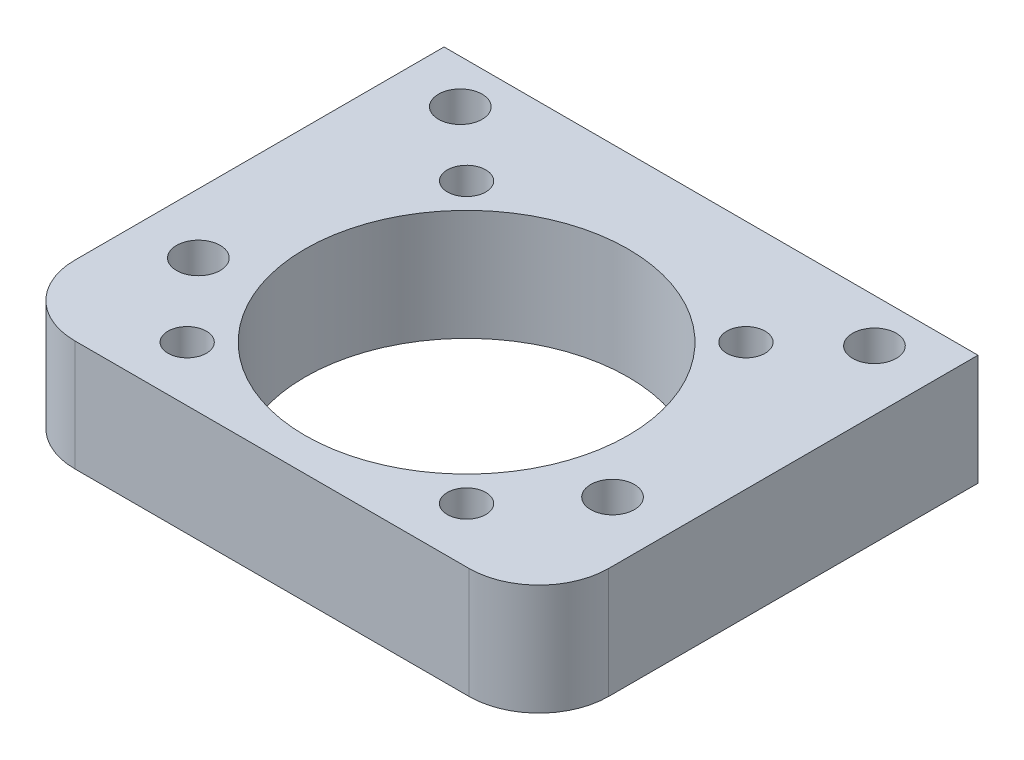
ISO-10303-21;
HEADER;
FILE_DESCRIPTION(('STEP AP214'),'2;1');
FILE_NAME('part.step','',(''),(''),'','','');
FILE_SCHEMA(('AUTOMOTIVE_DESIGN { 1 0 10303 214 1 1 1 1 }'));
ENDSEC;
DATA;
#1=APPLICATION_CONTEXT('core data for automotive mechanical design processes');
#2=APPLICATION_PROTOCOL_DEFINITION('international standard','automotive_design',2000,#1);
#3=PRODUCT_CONTEXT('',#1,'mechanical');
#4=PRODUCT('Part','Part','',(#3));
#5=PRODUCT_RELATED_PRODUCT_CATEGORY('part','',(#4));
#6=PRODUCT_DEFINITION_FORMATION('','',#4);
#7=PRODUCT_DEFINITION_CONTEXT('part definition',#1,'design');
#8=PRODUCT_DEFINITION('design','',#6,#7);
#9=PRODUCT_DEFINITION_SHAPE('','',#8);
#10=(LENGTH_UNIT() NAMED_UNIT(*) SI_UNIT(.MILLI.,.METRE.));
#11=(NAMED_UNIT(*) PLANE_ANGLE_UNIT() SI_UNIT($,.RADIAN.));
#12=(NAMED_UNIT(*) SI_UNIT($,.STERADIAN.) SOLID_ANGLE_UNIT());
#13=UNCERTAINTY_MEASURE_WITH_UNIT(LENGTH_MEASURE(1.E-05),#10,'distance_accuracy_value','');
#14=(GEOMETRIC_REPRESENTATION_CONTEXT(3) GLOBAL_UNCERTAINTY_ASSIGNED_CONTEXT((#13)) GLOBAL_UNIT_ASSIGNED_CONTEXT((#10,
#11,#12)) REPRESENTATION_CONTEXT('',''));
#15=CARTESIAN_POINT('',(0.,0.,0.));
#16=DIRECTION('',(0.,0.,1.));
#17=DIRECTION('',(1.,0.,0.));
#18=AXIS2_PLACEMENT_3D('',#15,#16,#17);
#19=CARTESIAN_POINT('',(11.2889800951195,0.,7.15000000000087));
#20=DIRECTION('',(0.,1.,0.));
#21=DIRECTION('',(0.,0.,1.));
#22=AXIS2_PLACEMENT_3D('',#19,#20,#21);
#23=CYLINDRICAL_SURFACE('',#22,4.00000000000011);
#24=CARTESIAN_POINT('',(11.2889800951195,6.34999999999999,7.15000000000087));
#25=DIRECTION('',(0.,1.,0.));
#26=DIRECTION('',(0.,0.,1.));
#27=AXIS2_PLACEMENT_3D('',#24,#25,#26);
#28=CIRCLE('',#27,4.00000000000011);
#29=CARTESIAN_POINT('',(11.2889800951195,6.34999999999999,11.150000000001));
#30=VERTEX_POINT('',#29);
#31=CARTESIAN_POINT('',(15.2889800951196,6.34999999999999,7.15000000000087));
#32=VERTEX_POINT('',#31);
#33=EDGE_CURVE('E122',#30,#32,#28,.T.);
#34=ORIENTED_EDGE('',*,*,#33,.F.);
#35=DIRECTION('',(0.,1.,0.));
#36=VECTOR('',#35,1.);
#37=CARTESIAN_POINT('',(11.2889800951195,0.,11.150000000001));
#38=LINE('',#37,#36);
#39=CARTESIAN_POINT('',(11.2889800951195,0.,11.150000000001));
#40=VERTEX_POINT('',#39);
#41=EDGE_CURVE('E11',#40,#30,#38,.T.);
#42=ORIENTED_EDGE('',*,*,#41,.F.);
#43=CARTESIAN_POINT('',(11.2889800951195,0.,7.15000000000087));
#44=DIRECTION('',(0.,1.,0.));
#45=DIRECTION('',(0.,0.,1.));
#46=AXIS2_PLACEMENT_3D('',#43,#44,#45);
#47=CIRCLE('',#46,4.00000000000011);
#48=CARTESIAN_POINT('',(15.2889800951196,0.,7.15000000000087));
#49=VERTEX_POINT('',#48);
#50=EDGE_CURVE('E137',#40,#49,#47,.T.);
#51=ORIENTED_EDGE('',*,*,#50,.T.);
#52=DIRECTION('',(0.,1.,0.));
#53=VECTOR('',#52,1.);
#54=CARTESIAN_POINT('',(15.2889800951196,0.,7.15000000000087));
#55=LINE('',#54,#53);
#56=EDGE_CURVE('E40',#49,#32,#55,.T.);
#57=ORIENTED_EDGE('',*,*,#56,.T.);
#58=EDGE_LOOP('',(#34,#42,#51,#57));
#59=FACE_BOUND('',#58,.T.);
#60=ADVANCED_FACE('F37',(#59),#23,.T.);
#61=CARTESIAN_POINT('',(-11.2890199048789,0.,11.150000000001));
#62=DIRECTION('',(0.,0.,1.));
#63=DIRECTION('',(1.,0.,0.));
#64=AXIS2_PLACEMENT_3D('',#61,#62,#63);
#65=PLANE('',#64);
#66=DIRECTION('',(1.,0.,0.));
#67=VECTOR('',#66,1.);
#68=CARTESIAN_POINT('',(-11.2890199048789,6.34999999999999,11.150000000001));
#69=LINE('',#68,#67);
#70=CARTESIAN_POINT('',(-11.2890199048789,6.34999999999999,11.150000000001));
#71=VERTEX_POINT('',#70);
#72=EDGE_CURVE('E135',#71,#30,#69,.T.);
#73=ORIENTED_EDGE('',*,*,#72,.F.);
#74=DIRECTION('',(0.,1.,0.));
#75=VECTOR('',#74,1.);
#76=CARTESIAN_POINT('',(-11.2890199048789,0.,11.150000000001));
#77=LINE('',#76,#75);
#78=CARTESIAN_POINT('',(-11.2890199048789,0.,11.150000000001));
#79=VERTEX_POINT('',#78);
#80=EDGE_CURVE('E46',#79,#71,#77,.T.);
#81=ORIENTED_EDGE('',*,*,#80,.F.);
#82=DIRECTION('',(1.,0.,0.));
#83=VECTOR('',#82,1.);
#84=CARTESIAN_POINT('',(-11.2890199048789,0.,11.150000000001));
#85=LINE('',#84,#83);
#86=EDGE_CURVE('E112',#79,#40,#85,.T.);
#87=ORIENTED_EDGE('',*,*,#86,.T.);
#88=ORIENTED_EDGE('',*,*,#41,.T.);
#89=EDGE_LOOP('',(#73,#81,#87,#88));
#90=FACE_BOUND('',#89,.T.);
#91=ADVANCED_FACE('F145',(#90),#65,.T.);
#92=CARTESIAN_POINT('',(-11.2890199048789,0.,7.14999999999758));
#93=DIRECTION('',(0.,1.,0.));
#94=DIRECTION('',(0.,0.,1.));
#95=AXIS2_PLACEMENT_3D('',#92,#93,#94);
#96=CYLINDRICAL_SURFACE('',#95,4.00000000000341);
#97=CARTESIAN_POINT('',(-11.2890199048789,6.34999999999999,7.14999999999758));
#98=DIRECTION('',(0.,1.,0.));
#99=DIRECTION('',(0.,0.,1.));
#100=AXIS2_PLACEMENT_3D('',#97,#98,#99);
#101=CIRCLE('',#100,4.00000000000341);
#102=CARTESIAN_POINT('',(-15.2890199048824,6.34999999999999,7.14999999999758));
#103=VERTEX_POINT('',#102);
#104=EDGE_CURVE('E99',#103,#71,#101,.T.);
#105=ORIENTED_EDGE('',*,*,#104,.F.);
#106=DIRECTION('',(0.,1.,0.));
#107=VECTOR('',#106,1.);
#108=CARTESIAN_POINT('',(-15.2890199048824,0.,7.14999999999758));
#109=LINE('',#108,#107);
#110=CARTESIAN_POINT('',(-15.2890199048824,0.,7.14999999999758));
#111=VERTEX_POINT('',#110);
#112=EDGE_CURVE('E94',#111,#103,#109,.T.);
#113=ORIENTED_EDGE('',*,*,#112,.F.);
#114=CARTESIAN_POINT('',(-11.2890199048789,0.,7.14999999999758));
#115=DIRECTION('',(0.,1.,0.));
#116=DIRECTION('',(0.,0.,1.));
#117=AXIS2_PLACEMENT_3D('',#114,#115,#116);
#118=CIRCLE('',#117,4.00000000000341);
#119=EDGE_CURVE('E97',#111,#79,#118,.T.);
#120=ORIENTED_EDGE('',*,*,#119,.T.);
#121=ORIENTED_EDGE('',*,*,#80,.T.);
#122=EDGE_LOOP('',(#105,#113,#120,#121));
#123=FACE_BOUND('',#122,.T.);
#124=ADVANCED_FACE('F96',(#123),#96,.T.);
#125=CARTESIAN_POINT('',(-15.2890199048824,0.,-14.0000000000007));
#126=DIRECTION('',(-1.,0.,0.));
#127=DIRECTION('',(0.,0.,1.));
#128=AXIS2_PLACEMENT_3D('',#125,#126,#127);
#129=PLANE('',#128);
#130=DIRECTION('',(0.,0.,1.));
#131=VECTOR('',#130,1.);
#132=CARTESIAN_POINT('',(-15.2890199048824,6.34999999999999,-14.0000000000007));
#133=LINE('',#132,#131);
#134=CARTESIAN_POINT('',(-15.2890199048824,6.34999999999999,-14.0000000000007));
#135=VERTEX_POINT('',#134);
#136=EDGE_CURVE('E132',#135,#103,#133,.T.);
#137=ORIENTED_EDGE('',*,*,#136,.F.);
#138=DIRECTION('',(0.,1.,0.));
#139=VECTOR('',#138,1.);
#140=CARTESIAN_POINT('',(-15.2890199048824,0.,-14.0000000000007));
#141=LINE('',#140,#139);
#142=CARTESIAN_POINT('',(-15.2890199048824,0.,-14.0000000000007));
#143=VERTEX_POINT('',#142);
#144=EDGE_CURVE('E104',#143,#135,#141,.T.);
#145=ORIENTED_EDGE('',*,*,#144,.F.);
#146=DIRECTION('',(0.,0.,1.));
#147=VECTOR('',#146,1.);
#148=CARTESIAN_POINT('',(-15.2890199048824,0.,-14.0000000000007));
#149=LINE('',#148,#147);
#150=EDGE_CURVE('E110',#143,#111,#149,.T.);
#151=ORIENTED_EDGE('',*,*,#150,.T.);
#152=ORIENTED_EDGE('',*,*,#112,.T.);
#153=EDGE_LOOP('',(#137,#145,#151,#152));
#154=FACE_BOUND('',#153,.T.);
#155=ADVANCED_FACE('F114',(#154),#129,.T.);
#156=CARTESIAN_POINT('',(15.2889800951196,0.,-14.0000000000007));
#157=DIRECTION('',(0.,0.,-1.));
#158=DIRECTION('',(-1.,0.,0.));
#159=AXIS2_PLACEMENT_3D('',#156,#157,#158);
#160=PLANE('',#159);
#161=DIRECTION('',(-1.,0.,0.));
#162=VECTOR('',#161,1.);
#163=CARTESIAN_POINT('',(15.2889800951196,6.34999999999999,-14.0000000000007));
#164=LINE('',#163,#162);
#165=CARTESIAN_POINT('',(15.2889800951196,6.34999999999999,-14.0000000000007));
#166=VERTEX_POINT('',#165);
#167=EDGE_CURVE('E129',#166,#135,#164,.T.);
#168=ORIENTED_EDGE('',*,*,#167,.F.);
#169=DIRECTION('',(0.,1.,0.));
#170=VECTOR('',#169,1.);
#171=CARTESIAN_POINT('',(15.2889800951196,0.,-14.0000000000007));
#172=LINE('',#171,#170);
#173=CARTESIAN_POINT('',(15.2889800951196,0.,-14.0000000000007));
#174=VERTEX_POINT('',#173);
#175=EDGE_CURVE('E140',#174,#166,#172,.T.);
#176=ORIENTED_EDGE('',*,*,#175,.F.);
#177=DIRECTION('',(-1.,0.,0.));
#178=VECTOR('',#177,1.);
#179=CARTESIAN_POINT('',(15.2889800951196,0.,-14.0000000000007));
#180=LINE('',#179,#178);
#181=EDGE_CURVE('E115',#174,#143,#180,.T.);
#182=ORIENTED_EDGE('',*,*,#181,.T.);
#183=ORIENTED_EDGE('',*,*,#144,.T.);
#184=EDGE_LOOP('',(#168,#176,#182,#183));
#185=FACE_BOUND('',#184,.T.);
#186=ADVANCED_FACE('F158',(#185),#160,.T.);
#187=CARTESIAN_POINT('',(15.2889800951196,0.,7.15000000000087));
#188=DIRECTION('',(1.,0.,0.));
#189=DIRECTION('',(0.,0.,-1.));
#190=AXIS2_PLACEMENT_3D('',#187,#188,#189);
#191=PLANE('',#190);
#192=DIRECTION('',(0.,0.,-1.));
#193=VECTOR('',#192,1.);
#194=CARTESIAN_POINT('',(15.2889800951196,6.34999999999999,7.15000000000087));
#195=LINE('',#194,#193);
#196=EDGE_CURVE('E125',#32,#166,#195,.T.);
#197=ORIENTED_EDGE('',*,*,#196,.F.);
#198=ORIENTED_EDGE('',*,*,#56,.F.);
#199=DIRECTION('',(0.,0.,-1.));
#200=VECTOR('',#199,1.);
#201=CARTESIAN_POINT('',(15.2889800951196,0.,7.15000000000087));
#202=LINE('',#201,#200);
#203=EDGE_CURVE('E117',#49,#174,#202,.T.);
#204=ORIENTED_EDGE('',*,*,#203,.T.);
#205=ORIENTED_EDGE('',*,*,#175,.T.);
#206=EDGE_LOOP('',(#197,#198,#204,#205));
#207=FACE_BOUND('',#206,.T.);
#208=ADVANCED_FACE('F142',(#207),#191,.T.);
#209=CARTESIAN_POINT('',(11.2889800951195,0.,7.15000000000087));
#210=DIRECTION('',(0.,1.,0.));
#211=DIRECTION('',(0.,0.,1.));
#212=AXIS2_PLACEMENT_3D('',#209,#210,#211);
#213=PLANE('',#212);
#214=CARTESIAN_POINT('',(11.859575542256,0.,3.50000000000059));
#215=DIRECTION('',(0.,-1.,0.));
#216=DIRECTION('',(0.,0.,-1.));
#217=AXIS2_PLACEMENT_3D('',#214,#215,#216);
#218=CIRCLE('',#217,1.24999999999999);
#219=CARTESIAN_POINT('',(11.859575542256,0.,2.2500000000006));
#220=VERTEX_POINT('',#219);
#221=EDGE_CURVE('E215',#220,#220,#218,.T.);
#222=ORIENTED_EDGE('',*,*,#221,.F.);
#223=EDGE_LOOP('',(#222));
#224=FACE_BOUND('',#223,.T.);
#225=CARTESIAN_POINT('',(11.8586470054873,0.,-11.4999999999994));
#226=DIRECTION('',(0.,-1.,0.));
#227=DIRECTION('',(0.,0.,-1.));
#228=AXIS2_PLACEMENT_3D('',#225,#226,#227);
#229=CIRCLE('',#228,1.24999999999999);
#230=CARTESIAN_POINT('',(11.8586470054873,0.,-12.7499999999994));
#231=VERTEX_POINT('',#230);
#232=EDGE_CURVE('E217',#231,#231,#229,.T.);
#233=ORIENTED_EDGE('',*,*,#232,.F.);
#234=EDGE_LOOP('',(#233));
#235=FACE_BOUND('',#234,.T.);
#236=CARTESIAN_POINT('',(-11.8595655897677,0.,3.50003372333488));
#237=DIRECTION('',(0.,-1.,0.));
#238=DIRECTION('',(0.,0.,-1.));
#239=AXIS2_PLACEMENT_3D('',#236,#237,#238);
#240=CIRCLE('',#239,1.24999999999999);
#241=CARTESIAN_POINT('',(-11.8595655897677,0.,2.25003372333489));
#242=VERTEX_POINT('',#241);
#243=EDGE_CURVE('E225',#242,#242,#240,.T.);
#244=ORIENTED_EDGE('',*,*,#243,.F.);
#245=EDGE_LOOP('',(#244));
#246=FACE_BOUND('',#245,.T.);
#247=CARTESIAN_POINT('',(-11.8586370762849,0.,-11.4999999999994));
#248=DIRECTION('',(0.,-1.,0.));
#249=DIRECTION('',(0.,0.,-1.));
#250=AXIS2_PLACEMENT_3D('',#247,#248,#249);
#251=CIRCLE('',#250,1.24999999999999);
#252=CARTESIAN_POINT('',(-11.8586370762849,0.,-12.7499999999994));
#253=VERTEX_POINT('',#252);
#254=EDGE_CURVE('E231',#253,#253,#251,.T.);
#255=ORIENTED_EDGE('',*,*,#254,.F.);
#256=EDGE_LOOP('',(#255));
#257=FACE_BOUND('',#256,.T.);
#258=CARTESIAN_POINT('',(0.,0.,0.));
#259=DIRECTION('',(0.,-1.,0.));
#260=DIRECTION('',(0.,0.,-1.));
#261=AXIS2_PLACEMENT_3D('',#258,#259,#260);
#262=CIRCLE('',#261,9.25);
#263=CARTESIAN_POINT('',(0.,0.,-9.25));
#264=VERTEX_POINT('',#263);
#265=EDGE_CURVE('E237',#264,#264,#262,.T.);
#266=ORIENTED_EDGE('',*,*,#265,.F.);
#267=EDGE_LOOP('',(#266));
#268=FACE_BOUND('',#267,.T.);
#269=CARTESIAN_POINT('',(-8.00001990488033,0.,8.00000000000009));
#270=DIRECTION('',(0.,1.,0.));
#271=DIRECTION('',(0.,0.,1.));
#272=AXIS2_PLACEMENT_3D('',#269,#270,#271);
#273=CIRCLE('',#272,1.10000000000004);
#274=CARTESIAN_POINT('',(-8.00001990488033,0.,9.10000000000013));
#275=VERTEX_POINT('',#274);
#276=EDGE_CURVE('E246',#275,#275,#273,.T.);
#277=ORIENTED_EDGE('',*,*,#276,.T.);
#278=EDGE_LOOP('',(#277));
#279=FACE_BOUND('',#278,.T.);
#280=CARTESIAN_POINT('',(7.99998009511978,0.,-7.99999999999978));
#281=DIRECTION('',(0.,-1.,0.));
#282=DIRECTION('',(0.,0.,-1.));
#283=AXIS2_PLACEMENT_3D('',#280,#281,#282);
#284=CIRCLE('',#283,1.09999999999999);
#285=CARTESIAN_POINT('',(7.99998009511978,0.,-9.09999999999977));
#286=VERTEX_POINT('',#285);
#287=EDGE_CURVE('E249',#286,#286,#284,.T.);
#288=ORIENTED_EDGE('',*,*,#287,.F.);
#289=EDGE_LOOP('',(#288));
#290=FACE_BOUND('',#289,.T.);
#291=CARTESIAN_POINT('',(-8.00001990488031,0.,-7.9999999999998));
#292=DIRECTION('',(0.,-1.,0.));
#293=DIRECTION('',(0.,0.,-1.));
#294=AXIS2_PLACEMENT_3D('',#291,#292,#293);
#295=CIRCLE('',#294,1.10000000000004);
#296=CARTESIAN_POINT('',(-8.00001990488031,0.,-9.09999999999984));
#297=VERTEX_POINT('',#296);
#298=EDGE_CURVE('E255',#297,#297,#295,.T.);
#299=ORIENTED_EDGE('',*,*,#298,.F.);
#300=EDGE_LOOP('',(#299));
#301=FACE_BOUND('',#300,.T.);
#302=CARTESIAN_POINT('',(7.99998009511976,0.,8.00000000000012));
#303=DIRECTION('',(0.,-1.,0.));
#304=DIRECTION('',(0.,0.,-1.));
#305=AXIS2_PLACEMENT_3D('',#302,#303,#304);
#306=CIRCLE('',#305,1.10000000000004);
#307=CARTESIAN_POINT('',(7.99998009511976,0.,6.90000000000007));
#308=VERTEX_POINT('',#307);
#309=EDGE_CURVE('E261',#308,#308,#306,.T.);
#310=ORIENTED_EDGE('',*,*,#309,.F.);
#311=EDGE_LOOP('',(#310));
#312=FACE_BOUND('',#311,.T.);
#313=ORIENTED_EDGE('',*,*,#50,.F.);
#314=ORIENTED_EDGE('',*,*,#86,.F.);
#315=ORIENTED_EDGE('',*,*,#119,.F.);
#316=ORIENTED_EDGE('',*,*,#150,.F.);
#317=ORIENTED_EDGE('',*,*,#181,.F.);
#318=ORIENTED_EDGE('',*,*,#203,.F.);
#319=EDGE_LOOP('',(#313,#314,#315,#316,#317,#318));
#320=FACE_BOUND('',#319,.T.);
#321=ADVANCED_FACE('F108',(#224,#235,#246,#257,#268,#279,#290,#301,#312,#320),#213,.F.);
#322=CARTESIAN_POINT('',(11.2889800951195,6.34999999999999,7.15000000000087));
#323=DIRECTION('',(0.,1.,0.));
#324=DIRECTION('',(0.,0.,1.));
#325=AXIS2_PLACEMENT_3D('',#322,#323,#324);
#326=PLANE('',#325);
#327=CARTESIAN_POINT('',(11.859575542256,6.34999999999999,3.50000000000059));
#328=DIRECTION('',(0.,-1.,0.));
#329=DIRECTION('',(0.,0.,-1.));
#330=AXIS2_PLACEMENT_3D('',#327,#328,#329);
#331=CIRCLE('',#330,1.24999999999999);
#332=CARTESIAN_POINT('',(11.859575542256,6.34999999999999,2.2500000000006));
#333=VERTEX_POINT('',#332);
#334=EDGE_CURVE('E213',#333,#333,#331,.T.);
#335=ORIENTED_EDGE('',*,*,#334,.T.);
#336=EDGE_LOOP('',(#335));
#337=FACE_BOUND('',#336,.T.);
#338=CARTESIAN_POINT('',(11.8586470054873,6.34999999999999,-11.4999999999994));
#339=DIRECTION('',(0.,-1.,0.));
#340=DIRECTION('',(0.,0.,-1.));
#341=AXIS2_PLACEMENT_3D('',#338,#339,#340);
#342=CIRCLE('',#341,1.24999999999999);
#343=CARTESIAN_POINT('',(11.8586470054873,6.34999999999999,-12.7499999999994));
#344=VERTEX_POINT('',#343);
#345=EDGE_CURVE('E222',#344,#344,#342,.T.);
#346=ORIENTED_EDGE('',*,*,#345,.T.);
#347=EDGE_LOOP('',(#346));
#348=FACE_BOUND('',#347,.T.);
#349=CARTESIAN_POINT('',(-11.8595655897677,6.34999999999999,3.50003372333488));
#350=DIRECTION('',(0.,-1.,0.));
#351=DIRECTION('',(0.,0.,-1.));
#352=AXIS2_PLACEMENT_3D('',#349,#350,#351);
#353=CIRCLE('',#352,1.24999999999999);
#354=CARTESIAN_POINT('',(-11.8595655897677,6.34999999999999,2.25003372333489));
#355=VERTEX_POINT('',#354);
#356=EDGE_CURVE('E228',#355,#355,#353,.T.);
#357=ORIENTED_EDGE('',*,*,#356,.T.);
#358=EDGE_LOOP('',(#357));
#359=FACE_BOUND('',#358,.T.);
#360=CARTESIAN_POINT('',(-11.8586370762849,6.34999999999999,-11.4999999999994));
#361=DIRECTION('',(0.,-1.,0.));
#362=DIRECTION('',(0.,0.,-1.));
#363=AXIS2_PLACEMENT_3D('',#360,#361,#362);
#364=CIRCLE('',#363,1.24999999999999);
#365=CARTESIAN_POINT('',(-11.8586370762849,6.34999999999999,-12.7499999999994));
#366=VERTEX_POINT('',#365);
#367=EDGE_CURVE('E234',#366,#366,#364,.T.);
#368=ORIENTED_EDGE('',*,*,#367,.T.);
#369=EDGE_LOOP('',(#368));
#370=FACE_BOUND('',#369,.T.);
#371=CARTESIAN_POINT('',(0.,6.34999999999999,0.));
#372=DIRECTION('',(0.,-1.,0.));
#373=DIRECTION('',(0.,0.,-1.));
#374=AXIS2_PLACEMENT_3D('',#371,#372,#373);
#375=CIRCLE('',#374,9.25);
#376=CARTESIAN_POINT('',(0.,6.34999999999999,-9.25));
#377=VERTEX_POINT('',#376);
#378=EDGE_CURVE('E240',#377,#377,#375,.T.);
#379=ORIENTED_EDGE('',*,*,#378,.T.);
#380=EDGE_LOOP('',(#379));
#381=FACE_BOUND('',#380,.T.);
#382=CARTESIAN_POINT('',(-8.00001990488033,6.34999999999999,8.00000000000009));
#383=DIRECTION('',(0.,1.,0.));
#384=DIRECTION('',(0.,0.,1.));
#385=AXIS2_PLACEMENT_3D('',#382,#383,#384);
#386=CIRCLE('',#385,1.10000000000004);
#387=CARTESIAN_POINT('',(-8.00001990488033,6.34999999999999,9.10000000000013));
#388=VERTEX_POINT('',#387);
#389=EDGE_CURVE('E243',#388,#388,#386,.T.);
#390=ORIENTED_EDGE('',*,*,#389,.F.);
#391=EDGE_LOOP('',(#390));
#392=FACE_BOUND('',#391,.T.);
#393=CARTESIAN_POINT('',(7.99998009511978,6.34999999999999,-7.99999999999978));
#394=DIRECTION('',(0.,-1.,0.));
#395=DIRECTION('',(0.,0.,-1.));
#396=AXIS2_PLACEMENT_3D('',#393,#394,#395);
#397=CIRCLE('',#396,1.09999999999999);
#398=CARTESIAN_POINT('',(7.99998009511978,6.34999999999999,-9.09999999999977));
#399=VERTEX_POINT('',#398);
#400=EDGE_CURVE('E252',#399,#399,#397,.T.);
#401=ORIENTED_EDGE('',*,*,#400,.T.);
#402=EDGE_LOOP('',(#401));
#403=FACE_BOUND('',#402,.T.);
#404=CARTESIAN_POINT('',(-8.00001990488031,6.34999999999999,-7.9999999999998));
#405=DIRECTION('',(0.,-1.,0.));
#406=DIRECTION('',(0.,0.,-1.));
#407=AXIS2_PLACEMENT_3D('',#404,#405,#406);
#408=CIRCLE('',#407,1.10000000000004);
#409=CARTESIAN_POINT('',(-8.00001990488031,6.34999999999999,-9.09999999999984));
#410=VERTEX_POINT('',#409);
#411=EDGE_CURVE('E258',#410,#410,#408,.T.);
#412=ORIENTED_EDGE('',*,*,#411,.T.);
#413=EDGE_LOOP('',(#412));
#414=FACE_BOUND('',#413,.T.);
#415=CARTESIAN_POINT('',(7.99998009511976,6.34999999999999,8.00000000000012));
#416=DIRECTION('',(0.,-1.,0.));
#417=DIRECTION('',(0.,0.,-1.));
#418=AXIS2_PLACEMENT_3D('',#415,#416,#417);
#419=CIRCLE('',#418,1.10000000000004);
#420=CARTESIAN_POINT('',(7.99998009511976,6.34999999999999,6.90000000000007));
#421=VERTEX_POINT('',#420);
#422=EDGE_CURVE('E126',#421,#421,#419,.T.);
#423=ORIENTED_EDGE('',*,*,#422,.T.);
#424=EDGE_LOOP('',(#423));
#425=FACE_BOUND('',#424,.T.);
#426=ORIENTED_EDGE('',*,*,#33,.T.);
#427=ORIENTED_EDGE('',*,*,#196,.T.);
#428=ORIENTED_EDGE('',*,*,#167,.T.);
#429=ORIENTED_EDGE('',*,*,#136,.T.);
#430=ORIENTED_EDGE('',*,*,#104,.T.);
#431=ORIENTED_EDGE('',*,*,#72,.T.);
#432=EDGE_LOOP('',(#426,#427,#428,#429,#430,#431));
#433=FACE_BOUND('',#432,.T.);
#434=ADVANCED_FACE('F144',(#337,#348,#359,#370,#381,#392,#403,#414,#425,#433),#326,.T.);
#435=CARTESIAN_POINT('',(7.99998009511976,0.,8.00000000000012));
#436=DIRECTION('',(0.,-1.,0.));
#437=DIRECTION('',(0.,0.,-1.));
#438=AXIS2_PLACEMENT_3D('',#435,#436,#437);
#439=CYLINDRICAL_SURFACE('',#438,1.10000000000004);
#440=ORIENTED_EDGE('',*,*,#422,.F.);
#441=EDGE_LOOP('',(#440));
#442=FACE_BOUND('',#441,.T.);
#443=ORIENTED_EDGE('',*,*,#309,.T.);
#444=EDGE_LOOP('',(#443));
#445=FACE_BOUND('',#444,.T.);
#446=ADVANCED_FACE('F169',(#442,#445),#439,.F.);
#447=CARTESIAN_POINT('',(-8.00001990488031,0.,-7.9999999999998));
#448=DIRECTION('',(0.,-1.,0.));
#449=DIRECTION('',(0.,0.,-1.));
#450=AXIS2_PLACEMENT_3D('',#447,#448,#449);
#451=CYLINDRICAL_SURFACE('',#450,1.10000000000004);
#452=ORIENTED_EDGE('',*,*,#411,.F.);
#453=EDGE_LOOP('',(#452));
#454=FACE_BOUND('',#453,.T.);
#455=ORIENTED_EDGE('',*,*,#298,.T.);
#456=EDGE_LOOP('',(#455));
#457=FACE_BOUND('',#456,.T.);
#458=ADVANCED_FACE('F176',(#454,#457),#451,.F.);
#459=CARTESIAN_POINT('',(7.99998009511978,0.,-7.99999999999978));
#460=DIRECTION('',(0.,-1.,0.));
#461=DIRECTION('',(0.,0.,-1.));
#462=AXIS2_PLACEMENT_3D('',#459,#460,#461);
#463=CYLINDRICAL_SURFACE('',#462,1.09999999999999);
#464=ORIENTED_EDGE('',*,*,#400,.F.);
#465=EDGE_LOOP('',(#464));
#466=FACE_BOUND('',#465,.T.);
#467=ORIENTED_EDGE('',*,*,#287,.T.);
#468=EDGE_LOOP('',(#467));
#469=FACE_BOUND('',#468,.T.);
#470=ADVANCED_FACE('F180',(#466,#469),#463,.F.);
#471=CARTESIAN_POINT('',(-8.00001990488033,6.34999999999999,8.00000000000009));
#472=DIRECTION('',(0.,1.,0.));
#473=DIRECTION('',(0.,0.,1.));
#474=AXIS2_PLACEMENT_3D('',#471,#472,#473);
#475=CYLINDRICAL_SURFACE('',#474,1.10000000000004);
#476=ORIENTED_EDGE('',*,*,#276,.F.);
#477=EDGE_LOOP('',(#476));
#478=FACE_BOUND('',#477,.T.);
#479=ORIENTED_EDGE('',*,*,#389,.T.);
#480=EDGE_LOOP('',(#479));
#481=FACE_BOUND('',#480,.T.);
#482=ADVANCED_FACE('F184',(#478,#481),#475,.F.);
#483=CARTESIAN_POINT('',(0.,0.,0.));
#484=DIRECTION('',(0.,-1.,0.));
#485=DIRECTION('',(0.,0.,-1.));
#486=AXIS2_PLACEMENT_3D('',#483,#484,#485);
#487=CYLINDRICAL_SURFACE('',#486,9.25);
#488=ORIENTED_EDGE('',*,*,#378,.F.);
#489=EDGE_LOOP('',(#488));
#490=FACE_BOUND('',#489,.T.);
#491=ORIENTED_EDGE('',*,*,#265,.T.);
#492=EDGE_LOOP('',(#491));
#493=FACE_BOUND('',#492,.T.);
#494=ADVANCED_FACE('F188',(#490,#493),#487,.F.);
#495=CARTESIAN_POINT('',(-11.8586370762849,0.,-11.4999999999994));
#496=DIRECTION('',(0.,-1.,0.));
#497=DIRECTION('',(0.,0.,-1.));
#498=AXIS2_PLACEMENT_3D('',#495,#496,#497);
#499=CYLINDRICAL_SURFACE('',#498,1.24999999999999);
#500=ORIENTED_EDGE('',*,*,#367,.F.);
#501=EDGE_LOOP('',(#500));
#502=FACE_BOUND('',#501,.T.);
#503=ORIENTED_EDGE('',*,*,#254,.T.);
#504=EDGE_LOOP('',(#503));
#505=FACE_BOUND('',#504,.T.);
#506=ADVANCED_FACE('F192',(#502,#505),#499,.F.);
#507=CARTESIAN_POINT('',(-11.8595655897677,0.,3.50003372333488));
#508=DIRECTION('',(0.,-1.,0.));
#509=DIRECTION('',(0.,0.,-1.));
#510=AXIS2_PLACEMENT_3D('',#507,#508,#509);
#511=CYLINDRICAL_SURFACE('',#510,1.24999999999999);
#512=ORIENTED_EDGE('',*,*,#356,.F.);
#513=EDGE_LOOP('',(#512));
#514=FACE_BOUND('',#513,.T.);
#515=ORIENTED_EDGE('',*,*,#243,.T.);
#516=EDGE_LOOP('',(#515));
#517=FACE_BOUND('',#516,.T.);
#518=ADVANCED_FACE('F196',(#514,#517),#511,.F.);
#519=CARTESIAN_POINT('',(11.8586470054873,0.,-11.4999999999994));
#520=DIRECTION('',(0.,-1.,0.));
#521=DIRECTION('',(0.,0.,-1.));
#522=AXIS2_PLACEMENT_3D('',#519,#520,#521);
#523=CYLINDRICAL_SURFACE('',#522,1.24999999999999);
#524=ORIENTED_EDGE('',*,*,#345,.F.);
#525=EDGE_LOOP('',(#524));
#526=FACE_BOUND('',#525,.T.);
#527=ORIENTED_EDGE('',*,*,#232,.T.);
#528=EDGE_LOOP('',(#527));
#529=FACE_BOUND('',#528,.T.);
#530=ADVANCED_FACE('F200',(#526,#529),#523,.F.);
#531=CARTESIAN_POINT('',(11.859575542256,0.,3.50000000000059));
#532=DIRECTION('',(0.,-1.,0.));
#533=DIRECTION('',(0.,0.,-1.));
#534=AXIS2_PLACEMENT_3D('',#531,#532,#533);
#535=CYLINDRICAL_SURFACE('',#534,1.24999999999999);
#536=ORIENTED_EDGE('',*,*,#334,.F.);
#537=EDGE_LOOP('',(#536));
#538=FACE_BOUND('',#537,.T.);
#539=ORIENTED_EDGE('',*,*,#221,.T.);
#540=EDGE_LOOP('',(#539));
#541=FACE_BOUND('',#540,.T.);
#542=ADVANCED_FACE('F204',(#538,#541),#535,.F.);
#543=CLOSED_SHELL('',(#60,#91,#124,#155,#186,#208,#321,#434,#446,#458,#470,#482,#494,#506,#518,
#530,#542));
#544=MANIFOLD_SOLID_BREP('B2',#543);
#545=ADVANCED_BREP_SHAPE_REPRESENTATION('',(#18,#544),#14);
#546=SHAPE_DEFINITION_REPRESENTATION(#9,#545);
ENDSEC;
END-ISO-10303-21;
